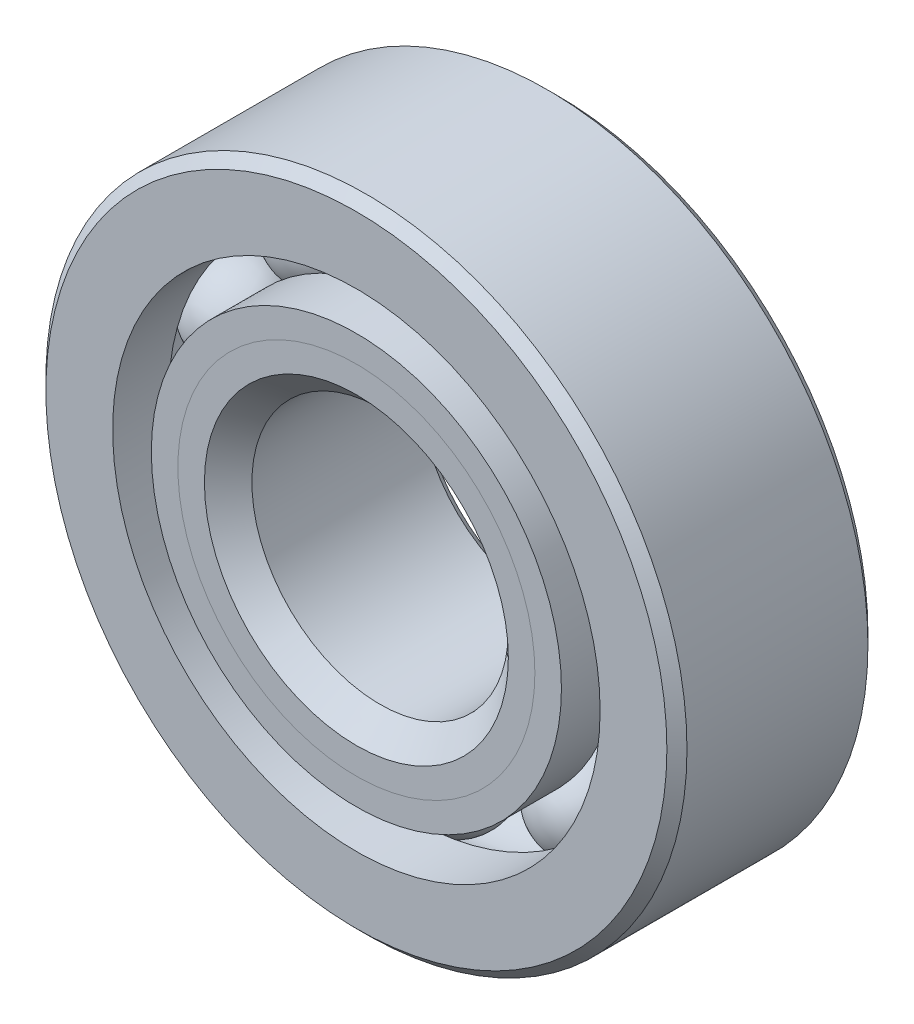
ISO-10303-21;
HEADER;
FILE_DESCRIPTION(('STEP AP214'),'2;1');
FILE_NAME('part.step','',(''),(''),'','','');
FILE_SCHEMA(('AUTOMOTIVE_DESIGN { 1 0 10303 214 1 1 1 1 }'));
ENDSEC;
DATA;
#1=APPLICATION_CONTEXT('core data for automotive mechanical design processes');
#2=APPLICATION_PROTOCOL_DEFINITION('international standard','automotive_design',2000,#1);
#3=PRODUCT_CONTEXT('',#1,'mechanical');
#4=PRODUCT('Part','Part','',(#3));
#5=PRODUCT_RELATED_PRODUCT_CATEGORY('part','',(#4));
#6=PRODUCT_DEFINITION_FORMATION('','',#4);
#7=PRODUCT_DEFINITION_CONTEXT('part definition',#1,'design');
#8=PRODUCT_DEFINITION('design','',#6,#7);
#9=PRODUCT_DEFINITION_SHAPE('','',#8);
#10=(LENGTH_UNIT() NAMED_UNIT(*) SI_UNIT(.MILLI.,.METRE.));
#11=(NAMED_UNIT(*) PLANE_ANGLE_UNIT() SI_UNIT($,.RADIAN.));
#12=(NAMED_UNIT(*) SI_UNIT($,.STERADIAN.) SOLID_ANGLE_UNIT());
#13=UNCERTAINTY_MEASURE_WITH_UNIT(LENGTH_MEASURE(1.E-05),#10,'distance_accuracy_value','');
#14=(GEOMETRIC_REPRESENTATION_CONTEXT(3) GLOBAL_UNCERTAINTY_ASSIGNED_CONTEXT((#13)) GLOBAL_UNIT_ASSIGNED_CONTEXT((#10,
#11,#12)) REPRESENTATION_CONTEXT('',''));
#15=CARTESIAN_POINT('',(0.,0.,0.));
#16=DIRECTION('',(0.,0.,1.));
#17=DIRECTION('',(1.,0.,0.));
#18=AXIS2_PLACEMENT_3D('',#15,#16,#17);
#19=CARTESIAN_POINT('',(-3.26588180805,4.49510067499584,0.));
#20=DIRECTION('',(0.,0.,1.));
#21=DIRECTION('',(-0.587785252292462,0.809016994374955,0.));
#22=AXIS2_PLACEMENT_3D('',#19,#20,#21);
#23=SPHERICAL_SURFACE('',#22,1.20554465033679);
#24=CARTESIAN_POINT('',(-3.26588180805,4.49510067499584,1.20554465033679));
#25=VERTEX_POINT('',#24);
#26=VERTEX_LOOP('',#25);
#27=FACE_BOUND('',#26,.T.);
#28=ADVANCED_FACE('F37',(#27),#23,.T.);
#29=CLOSED_SHELL('',(#28));
#30=MANIFOLD_SOLID_BREP('B2',#29);
#31=CARTESIAN_POINT('',(-5.28430776866493,1.71697567499586,0.));
#32=DIRECTION('',(0.,0.,1.));
#33=DIRECTION('',(-0.95105651629515,0.309016994374958,0.));
#34=AXIS2_PLACEMENT_3D('',#31,#32,#33);
#35=SPHERICAL_SURFACE('',#34,1.20554465033679);
#36=CARTESIAN_POINT('',(-5.28430776866493,1.71697567499586,1.20554465033679));
#37=VERTEX_POINT('',#36);
#38=VERTEX_LOOP('',#37);
#39=FACE_BOUND('',#38,.T.);
#40=ADVANCED_FACE('F68',(#39),#35,.T.);
#41=CLOSED_SHELL('',(#40));
#42=MANIFOLD_SOLID_BREP('B6',#41);
#43=CARTESIAN_POINT('',(-5.28430776866496,-1.71697567499575,0.));
#44=DIRECTION('',(0.,0.,1.));
#45=DIRECTION('',(-0.951056516295157,-0.309016994374938,0.));
#46=AXIS2_PLACEMENT_3D('',#43,#44,#45);
#47=SPHERICAL_SURFACE('',#46,1.20554465033679);
#48=CARTESIAN_POINT('',(-5.28430776866496,-1.71697567499575,1.20554465033679));
#49=VERTEX_POINT('',#48);
#50=VERTEX_LOOP('',#49);
#51=FACE_BOUND('',#50,.T.);
#52=ADVANCED_FACE('F99',(#51),#47,.T.);
#53=CLOSED_SHELL('',(#52));
#54=MANIFOLD_SOLID_BREP('B33',#53);
#55=CARTESIAN_POINT('',(-3.26588180805009,-4.49510067499577,0.));
#56=DIRECTION('',(0.,0.,1.));
#57=DIRECTION('',(-0.58778525229248,-0.809016994374942,0.));
#58=AXIS2_PLACEMENT_3D('',#55,#56,#57);
#59=SPHERICAL_SURFACE('',#58,1.20554465033679);
#60=CARTESIAN_POINT('',(-3.26588180805009,-4.49510067499577,1.20554465033679));
#61=VERTEX_POINT('',#60);
#62=VERTEX_LOOP('',#61);
#63=FACE_BOUND('',#62,.T.);
#64=ADVANCED_FACE('F130',(#63),#59,.T.);
#65=CLOSED_SHELL('',(#64));
#66=MANIFOLD_SOLID_BREP('B64',#65);
#67=CARTESIAN_POINT('',(0.,-5.55625,0.));
#68=DIRECTION('',(0.,0.,1.));
#69=DIRECTION('',(0.,-1.,0.));
#70=AXIS2_PLACEMENT_3D('',#67,#68,#69);
#71=SPHERICAL_SURFACE('',#70,1.20554465033679);
#72=CARTESIAN_POINT('',(0.,-5.55625,1.20554465033679));
#73=VERTEX_POINT('',#72);
#74=VERTEX_LOOP('',#73);
#75=FACE_BOUND('',#74,.T.);
#76=ADVANCED_FACE('F161',(#75),#71,.T.);
#77=CLOSED_SHELL('',(#76));
#78=MANIFOLD_SOLID_BREP('B95',#77);
#79=CARTESIAN_POINT('',(3.26588180805003,-4.49510067499582,0.));
#80=DIRECTION('',(0.,0.,1.));
#81=DIRECTION('',(0.587785252292469,-0.809016994374951,0.));
#82=AXIS2_PLACEMENT_3D('',#79,#80,#81);
#83=SPHERICAL_SURFACE('',#82,1.20554465033679);
#84=CARTESIAN_POINT('',(3.26588180805003,-4.49510067499582,1.20554465033679));
#85=VERTEX_POINT('',#84);
#86=VERTEX_LOOP('',#85);
#87=FACE_BOUND('',#86,.T.);
#88=ADVANCED_FACE('F192',(#87),#83,.T.);
#89=CLOSED_SHELL('',(#88));
#90=MANIFOLD_SOLID_BREP('B126',#89);
#91=CARTESIAN_POINT('',(5.28430776866494,-1.71697567499582,0.));
#92=DIRECTION('',(0.,0.,1.));
#93=DIRECTION('',(0.951056516295152,-0.309016994374952,0.));
#94=AXIS2_PLACEMENT_3D('',#91,#92,#93);
#95=SPHERICAL_SURFACE('',#94,1.20554465033679);
#96=CARTESIAN_POINT('',(5.28430776866494,-1.71697567499582,1.20554465033679));
#97=VERTEX_POINT('',#96);
#98=VERTEX_LOOP('',#97);
#99=FACE_BOUND('',#98,.T.);
#100=ADVANCED_FACE('F223',(#99),#95,.T.);
#101=CLOSED_SHELL('',(#100));
#102=MANIFOLD_SOLID_BREP('B157',#101);
#103=CARTESIAN_POINT('',(5.28430776866495,1.71697567499579,0.));
#104=DIRECTION('',(0.,0.,1.));
#105=DIRECTION('',(0.951056516295155,0.309016994374945,0.));
#106=AXIS2_PLACEMENT_3D('',#103,#104,#105);
#107=SPHERICAL_SURFACE('',#106,1.20554465033679);
#108=CARTESIAN_POINT('',(5.28430776866495,1.71697567499579,1.20554465033679));
#109=VERTEX_POINT('',#108);
#110=VERTEX_LOOP('',#109);
#111=FACE_BOUND('',#110,.T.);
#112=ADVANCED_FACE('F254',(#111),#107,.T.);
#113=CLOSED_SHELL('',(#112));
#114=MANIFOLD_SOLID_BREP('B188',#113);
#115=CARTESIAN_POINT('',(3.26588180805006,4.4951006749958,0.));
#116=DIRECTION('',(0.,0.,1.));
#117=DIRECTION('',(0.587785252292474,0.809016994374947,0.));
#118=AXIS2_PLACEMENT_3D('',#115,#116,#117);
#119=SPHERICAL_SURFACE('',#118,1.20554465033679);
#120=CARTESIAN_POINT('',(3.26588180805006,4.4951006749958,1.20554465033679));
#121=VERTEX_POINT('',#120);
#122=VERTEX_LOOP('',#121);
#123=FACE_BOUND('',#122,.T.);
#124=ADVANCED_FACE('F285',(#123),#119,.T.);
#125=CLOSED_SHELL('',(#124));
#126=MANIFOLD_SOLID_BREP('B219',#125);
#127=CARTESIAN_POINT('',(0.,5.55625,0.));
#128=DIRECTION('',(0.,0.,1.));
#129=DIRECTION('',(0.,1.,0.));
#130=AXIS2_PLACEMENT_3D('',#127,#128,#129);
#131=SPHERICAL_SURFACE('',#130,1.20554465033679);
#132=CARTESIAN_POINT('',(0.,5.55625,1.20554465033679));
#133=VERTEX_POINT('',#132);
#134=VERTEX_LOOP('',#133);
#135=FACE_BOUND('',#134,.T.);
#136=ADVANCED_FACE('F318',(#135),#131,.T.);
#137=CLOSED_SHELL('',(#136));
#138=MANIFOLD_SOLID_BREP('B250',#137);
#139=CARTESIAN_POINT('',(0.,4.42006562313009,2.4892));
#140=DIRECTION('',(0.,0.,-1.));
#141=DIRECTION('',(-1.,0.,0.));
#142=AXIS2_PLACEMENT_3D('',#139,#140,#141);
#143=PLANE('',#142);
#144=CARTESIAN_POINT('',(0.,0.,2.4892));
#145=DIRECTION('',(0.,0.,1.));
#146=DIRECTION('',(1.,0.,0.));
#147=AXIS2_PLACEMENT_3D('',#144,#145,#146);
#148=CIRCLE('',#147,3.7628526748316);
#149=CARTESIAN_POINT('',(3.7628526748316,0.,2.4892));
#150=VERTEX_POINT('',#149);
#151=EDGE_CURVE('E372',#150,#150,#148,.T.);
#152=ORIENTED_EDGE('',*,*,#151,.F.);
#153=EDGE_LOOP('',(#152));
#154=FACE_BOUND('',#153,.T.);
#155=CARTESIAN_POINT('',(0.,0.,2.4892));
#156=DIRECTION('',(0.,0.,1.));
#157=DIRECTION('',(1.,0.,0.));
#158=AXIS2_PLACEMENT_3D('',#155,#156,#157);
#159=CIRCLE('',#158,4.42006562313009);
#160=CARTESIAN_POINT('',(4.42006562313009,0.,2.4892));
#161=VERTEX_POINT('',#160);
#162=EDGE_CURVE('E317',#161,#161,#159,.T.);
#163=ORIENTED_EDGE('',*,*,#162,.T.);
#164=EDGE_LOOP('',(#163));
#165=FACE_BOUND('',#164,.T.);
#166=ADVANCED_FACE('F338',(#154,#165),#143,.F.);
#167=CARTESIAN_POINT('',(0.,0.,1.83198705170152));
#168=DIRECTION('',(0.,0.,1.));
#169=DIRECTION('',(1.,0.,0.));
#170=AXIS2_PLACEMENT_3D('',#167,#168,#169);
#171=CONICAL_SURFACE('',#170,3.7628526748316,0.78539816339745);
#172=ORIENTED_EDGE('',*,*,#162,.F.);
#173=EDGE_LOOP('',(#172));
#174=FACE_BOUND('',#173,.T.);
#175=CARTESIAN_POINT('',(0.,0.,1.83198705170152));
#176=DIRECTION('',(0.,0.,1.));
#177=DIRECTION('',(1.,0.,0.));
#178=AXIS2_PLACEMENT_3D('',#175,#176,#177);
#179=CIRCLE('',#178,3.7628526748316);
#180=CARTESIAN_POINT('',(3.7628526748316,0.,1.83198705170152));
#181=VERTEX_POINT('',#180);
#182=EDGE_CURVE('E344',#181,#181,#179,.T.);
#183=ORIENTED_EDGE('',*,*,#182,.T.);
#184=EDGE_LOOP('',(#183));
#185=FACE_BOUND('',#184,.T.);
#186=ADVANCED_FACE('F379',(#174,#185),#171,.T.);
#187=CARTESIAN_POINT('',(0.,0.,2.4892));
#188=DIRECTION('',(0.,0.,1.));
#189=DIRECTION('',(1.,0.,0.));
#190=AXIS2_PLACEMENT_3D('',#187,#188,#189);
#191=CYLINDRICAL_SURFACE('',#190,3.7628526748316);
#192=ORIENTED_EDGE('',*,*,#182,.F.);
#193=EDGE_LOOP('',(#192));
#194=FACE_BOUND('',#193,.T.);
#195=CARTESIAN_POINT('',(0.,0.,0.));
#196=DIRECTION('',(0.,0.,1.));
#197=DIRECTION('',(1.,0.,0.));
#198=AXIS2_PLACEMENT_3D('',#195,#196,#197);
#199=CIRCLE('',#198,3.7628526748316);
#200=CARTESIAN_POINT('',(3.7628526748316,0.,0.));
#201=VERTEX_POINT('',#200);
#202=EDGE_CURVE('E348',#201,#201,#199,.T.);
#203=ORIENTED_EDGE('',*,*,#202,.T.);
#204=EDGE_LOOP('',(#203));
#205=FACE_BOUND('',#204,.T.);
#206=ADVANCED_FACE('F383',(#194,#205),#191,.T.);
#207=CARTESIAN_POINT('',(0.,3.7628526748316,0.));
#208=DIRECTION('',(0.,0.,-1.));
#209=DIRECTION('',(-1.,0.,0.));
#210=AXIS2_PLACEMENT_3D('',#207,#208,#209);
#211=PLANE('',#210);
#212=ORIENTED_EDGE('',*,*,#202,.F.);
#213=EDGE_LOOP('',(#212));
#214=FACE_BOUND('',#213,.T.);
#215=CARTESIAN_POINT('',(0.,0.,0.));
#216=DIRECTION('',(0.,0.,1.));
#217=DIRECTION('',(1.,0.,0.));
#218=AXIS2_PLACEMENT_3D('',#215,#216,#217);
#219=CIRCLE('',#218,4.35070534966321);
#220=CARTESIAN_POINT('',(4.35070534966321,0.,0.));
#221=VERTEX_POINT('',#220);
#222=EDGE_CURVE('E352',#221,#221,#219,.T.);
#223=ORIENTED_EDGE('',*,*,#222,.T.);
#224=EDGE_LOOP('',(#223));
#225=FACE_BOUND('',#224,.T.);
#226=ADVANCED_FACE('F388',(#214,#225),#211,.F.);
#227=CARTESIAN_POINT('',(0.,0.,0.));
#228=DIRECTION('',(0.,0.,1.));
#229=DIRECTION('',(1.,0.,0.));
#230=AXIS2_PLACEMENT_3D('',#227,#228,#229);
#231=TOROIDAL_SURFACE('',#230,5.55625,1.20554465033679);
#232=ORIENTED_EDGE('',*,*,#222,.F.);
#233=EDGE_LOOP('',(#232));
#234=FACE_BOUND('',#233,.T.);
#235=CARTESIAN_POINT('',(0.,0.,-1.10631111111111));
#236=DIRECTION('',(0.,0.,1.));
#237=DIRECTION('',(1.,0.,0.));
#238=AXIS2_PLACEMENT_3D('',#235,#236,#237);
#239=CIRCLE('',#238,5.07727857142857);
#240=CARTESIAN_POINT('',(5.07727857142857,0.,-1.10631111111111));
#241=VERTEX_POINT('',#240);
#242=EDGE_CURVE('E357',#241,#241,#239,.T.);
#243=ORIENTED_EDGE('',*,*,#242,.T.);
#244=EDGE_LOOP('',(#243));
#245=FACE_BOUND('',#244,.T.);
#246=ADVANCED_FACE('F394',(#234,#245),#231,.F.);
#247=CARTESIAN_POINT('',(0.,0.,2.4892));
#248=DIRECTION('',(0.,0.,1.));
#249=DIRECTION('',(1.,0.,0.));
#250=AXIS2_PLACEMENT_3D('',#247,#248,#249);
#251=CYLINDRICAL_SURFACE('',#250,5.07727857142857);
#252=ORIENTED_EDGE('',*,*,#242,.F.);
#253=EDGE_LOOP('',(#252));
#254=FACE_BOUND('',#253,.T.);
#255=CARTESIAN_POINT('',(0.,0.,-2.4892));
#256=DIRECTION('',(0.,0.,1.));
#257=DIRECTION('',(1.,0.,0.));
#258=AXIS2_PLACEMENT_3D('',#255,#256,#257);
#259=CIRCLE('',#258,5.07727857142857);
#260=CARTESIAN_POINT('',(5.07727857142857,0.,-2.4892));
#261=VERTEX_POINT('',#260);
#262=EDGE_CURVE('E360',#261,#261,#259,.T.);
#263=ORIENTED_EDGE('',*,*,#262,.T.);
#264=EDGE_LOOP('',(#263));
#265=FACE_BOUND('',#264,.T.);
#266=ADVANCED_FACE('F398',(#254,#265),#251,.T.);
#267=CARTESIAN_POINT('',(0.,3.42392,-2.4892));
#268=DIRECTION('',(0.,0.,1.));
#269=DIRECTION('',(1.,0.,0.));
#270=AXIS2_PLACEMENT_3D('',#267,#268,#269);
#271=PLANE('',#270);
#272=ORIENTED_EDGE('',*,*,#262,.F.);
#273=EDGE_LOOP('',(#272));
#274=FACE_BOUND('',#273,.T.);
#275=CARTESIAN_POINT('',(0.,0.,-2.4892));
#276=DIRECTION('',(0.,0.,1.));
#277=DIRECTION('',(1.,0.,0.));
#278=AXIS2_PLACEMENT_3D('',#275,#276,#277);
#279=CIRCLE('',#278,3.42392);
#280=CARTESIAN_POINT('',(3.42392,0.,-2.4892));
#281=VERTEX_POINT('',#280);
#282=EDGE_CURVE('E363',#281,#281,#279,.T.);
#283=ORIENTED_EDGE('',*,*,#282,.T.);
#284=EDGE_LOOP('',(#283));
#285=FACE_BOUND('',#284,.T.);
#286=ADVANCED_FACE('F402',(#274,#285),#271,.F.);
#287=CARTESIAN_POINT('',(0.,0.,-2.24028));
#288=DIRECTION('',(0.,0.,-1.));
#289=DIRECTION('',(-1.,0.,0.));
#290=AXIS2_PLACEMENT_3D('',#287,#288,#289);
#291=CONICAL_SURFACE('',#290,3.175,0.785398163397447);
#292=ORIENTED_EDGE('',*,*,#282,.F.);
#293=EDGE_LOOP('',(#292));
#294=FACE_BOUND('',#293,.T.);
#295=CARTESIAN_POINT('',(0.,0.,-2.24028));
#296=DIRECTION('',(0.,0.,1.));
#297=DIRECTION('',(1.,0.,0.));
#298=AXIS2_PLACEMENT_3D('',#295,#296,#297);
#299=CIRCLE('',#298,3.175);
#300=CARTESIAN_POINT('',(3.175,0.,-2.24028));
#301=VERTEX_POINT('',#300);
#302=EDGE_CURVE('E366',#301,#301,#299,.T.);
#303=ORIENTED_EDGE('',*,*,#302,.T.);
#304=EDGE_LOOP('',(#303));
#305=FACE_BOUND('',#304,.T.);
#306=ADVANCED_FACE('F406',(#294,#305),#291,.F.);
#307=CARTESIAN_POINT('',(0.,0.,2.4892));
#308=DIRECTION('',(0.,0.,1.));
#309=DIRECTION('',(1.,0.,0.));
#310=AXIS2_PLACEMENT_3D('',#307,#308,#309);
#311=CYLINDRICAL_SURFACE('',#310,3.175);
#312=ORIENTED_EDGE('',*,*,#302,.F.);
#313=EDGE_LOOP('',(#312));
#314=FACE_BOUND('',#313,.T.);
#315=CARTESIAN_POINT('',(0.,0.,1.9013473251684));
#316=DIRECTION('',(0.,0.,1.));
#317=DIRECTION('',(1.,0.,0.));
#318=AXIS2_PLACEMENT_3D('',#315,#316,#317);
#319=CIRCLE('',#318,3.175);
#320=CARTESIAN_POINT('',(3.175,0.,1.9013473251684));
#321=VERTEX_POINT('',#320);
#322=EDGE_CURVE('E369',#321,#321,#319,.T.);
#323=ORIENTED_EDGE('',*,*,#322,.T.);
#324=EDGE_LOOP('',(#323));
#325=FACE_BOUND('',#324,.T.);
#326=ADVANCED_FACE('F410',(#314,#325),#311,.F.);
#327=CARTESIAN_POINT('',(0.,0.,2.4892));
#328=DIRECTION('',(0.,0.,1.));
#329=DIRECTION('',(1.,0.,0.));
#330=AXIS2_PLACEMENT_3D('',#327,#328,#329);
#331=CONICAL_SURFACE('',#330,3.7628526748316,0.785398163397449);
#332=ORIENTED_EDGE('',*,*,#322,.F.);
#333=EDGE_LOOP('',(#332));
#334=FACE_BOUND('',#333,.T.);
#335=ORIENTED_EDGE('',*,*,#151,.T.);
#336=EDGE_LOOP('',(#335));
#337=FACE_BOUND('',#336,.T.);
#338=ADVANCED_FACE('F376',(#334,#337),#331,.F.);
#339=CLOSED_SHELL('',(#166,#186,#206,#226,#246,#266,#286,#306,#326,#338));
#340=MANIFOLD_SOLID_BREP('B281',#339);
#341=CARTESIAN_POINT('',(0.,5.07727857142857,2.4892));
#342=DIRECTION('',(0.,0.,-1.));
#343=DIRECTION('',(-1.,0.,0.));
#344=AXIS2_PLACEMENT_3D('',#341,#342,#343);
#345=PLANE('',#344);
#346=CARTESIAN_POINT('',(0.,0.,2.4892));
#347=DIRECTION('',(0.,0.,1.));
#348=DIRECTION('',(1.,0.,0.));
#349=AXIS2_PLACEMENT_3D('',#346,#347,#348);
#350=CIRCLE('',#349,4.42006562313009);
#351=CARTESIAN_POINT('',(4.42006562313009,0.,2.4892));
#352=VERTEX_POINT('',#351);
#353=EDGE_CURVE('E337',#352,#352,#350,.T.);
#354=ORIENTED_EDGE('',*,*,#353,.F.);
#355=EDGE_LOOP('',(#354));
#356=FACE_BOUND('',#355,.T.);
#357=CARTESIAN_POINT('',(0.,0.,2.4892));
#358=DIRECTION('',(0.,0.,1.));
#359=DIRECTION('',(1.,0.,0.));
#360=AXIS2_PLACEMENT_3D('',#357,#358,#359);
#361=CIRCLE('',#360,5.07727857142857);
#362=CARTESIAN_POINT('',(5.07727857142857,0.,2.4892));
#363=VERTEX_POINT('',#362);
#364=EDGE_CURVE('E518',#363,#363,#361,.T.);
#365=ORIENTED_EDGE('',*,*,#364,.T.);
#366=EDGE_LOOP('',(#365));
#367=FACE_BOUND('',#366,.T.);
#368=ADVANCED_FACE('F496',(#356,#367),#345,.F.);
#369=CARTESIAN_POINT('',(0.,0.,2.4892));
#370=DIRECTION('',(0.,0.,1.));
#371=DIRECTION('',(1.,0.,0.));
#372=AXIS2_PLACEMENT_3D('',#369,#370,#371);
#373=CONICAL_SURFACE('',#372,4.42006562313009,0.78539816339745);
#374=CARTESIAN_POINT('',(0.,0.,1.83198705170152));
#375=DIRECTION('',(0.,0.,1.));
#376=DIRECTION('',(1.,0.,0.));
#377=AXIS2_PLACEMENT_3D('',#374,#375,#376);
#378=CIRCLE('',#377,3.7628526748316);
#379=CARTESIAN_POINT('',(3.7628526748316,0.,1.83198705170152));
#380=VERTEX_POINT('',#379);
#381=EDGE_CURVE('E502',#380,#380,#378,.T.);
#382=ORIENTED_EDGE('',*,*,#381,.F.);
#383=EDGE_LOOP('',(#382));
#384=FACE_BOUND('',#383,.T.);
#385=ORIENTED_EDGE('',*,*,#353,.T.);
#386=EDGE_LOOP('',(#385));
#387=FACE_BOUND('',#386,.T.);
#388=ADVANCED_FACE('F543',(#384,#387),#373,.F.);
#389=CARTESIAN_POINT('',(0.,0.,2.4892));
#390=DIRECTION('',(0.,0.,1.));
#391=DIRECTION('',(1.,0.,0.));
#392=AXIS2_PLACEMENT_3D('',#389,#390,#391);
#393=CYLINDRICAL_SURFACE('',#392,3.7628526748316);
#394=CARTESIAN_POINT('',(0.,0.,0.));
#395=DIRECTION('',(0.,0.,1.));
#396=DIRECTION('',(1.,0.,0.));
#397=AXIS2_PLACEMENT_3D('',#394,#395,#396);
#398=CIRCLE('',#397,3.7628526748316);
#399=CARTESIAN_POINT('',(3.7628526748316,0.,0.));
#400=VERTEX_POINT('',#399);
#401=EDGE_CURVE('E506',#400,#400,#398,.T.);
#402=ORIENTED_EDGE('',*,*,#401,.F.);
#403=EDGE_LOOP('',(#402));
#404=FACE_BOUND('',#403,.T.);
#405=ORIENTED_EDGE('',*,*,#381,.T.);
#406=EDGE_LOOP('',(#405));
#407=FACE_BOUND('',#406,.T.);
#408=ADVANCED_FACE('F538',(#404,#407),#393,.F.);
#409=CARTESIAN_POINT('',(0.,3.7628526748316,0.));
#410=DIRECTION('',(0.,0.,1.));
#411=DIRECTION('',(1.,0.,0.));
#412=AXIS2_PLACEMENT_3D('',#409,#410,#411);
#413=PLANE('',#412);
#414=CARTESIAN_POINT('',(0.,0.,0.));
#415=DIRECTION('',(0.,0.,1.));
#416=DIRECTION('',(1.,0.,0.));
#417=AXIS2_PLACEMENT_3D('',#414,#415,#416);
#418=CIRCLE('',#417,4.35070534966321);
#419=CARTESIAN_POINT('',(4.35070534966321,0.,0.));
#420=VERTEX_POINT('',#419);
#421=EDGE_CURVE('E510',#420,#420,#418,.T.);
#422=ORIENTED_EDGE('',*,*,#421,.F.);
#423=EDGE_LOOP('',(#422));
#424=FACE_BOUND('',#423,.T.);
#425=ORIENTED_EDGE('',*,*,#401,.T.);
#426=EDGE_LOOP('',(#425));
#427=FACE_BOUND('',#426,.T.);
#428=ADVANCED_FACE('F532',(#424,#427),#413,.F.);
#429=CARTESIAN_POINT('',(0.,0.,0.));
#430=DIRECTION('',(0.,0.,1.));
#431=DIRECTION('',(1.,0.,0.));
#432=AXIS2_PLACEMENT_3D('',#429,#430,#431);
#433=TOROIDAL_SURFACE('',#432,5.55625,1.20554465033679);
#434=CARTESIAN_POINT('',(0.,0.,1.10631111111111));
#435=DIRECTION('',(0.,0.,1.));
#436=DIRECTION('',(1.,0.,0.));
#437=AXIS2_PLACEMENT_3D('',#434,#435,#436);
#438=CIRCLE('',#437,5.07727857142857);
#439=CARTESIAN_POINT('',(5.07727857142857,0.,1.10631111111111));
#440=VERTEX_POINT('',#439);
#441=EDGE_CURVE('E515',#440,#440,#438,.T.);
#442=ORIENTED_EDGE('',*,*,#441,.F.);
#443=EDGE_LOOP('',(#442));
#444=FACE_BOUND('',#443,.T.);
#445=ORIENTED_EDGE('',*,*,#421,.T.);
#446=EDGE_LOOP('',(#445));
#447=FACE_BOUND('',#446,.T.);
#448=ADVANCED_FACE('F526',(#444,#447),#433,.F.);
#449=CARTESIAN_POINT('',(0.,0.,2.4892));
#450=DIRECTION('',(0.,0.,1.));
#451=DIRECTION('',(1.,0.,0.));
#452=AXIS2_PLACEMENT_3D('',#449,#450,#451);
#453=CYLINDRICAL_SURFACE('',#452,5.07727857142857);
#454=ORIENTED_EDGE('',*,*,#364,.F.);
#455=EDGE_LOOP('',(#454));
#456=FACE_BOUND('',#455,.T.);
#457=ORIENTED_EDGE('',*,*,#441,.T.);
#458=EDGE_LOOP('',(#457));
#459=FACE_BOUND('',#458,.T.);
#460=ADVANCED_FACE('F523',(#456,#459),#453,.T.);
#461=CLOSED_SHELL('',(#368,#388,#408,#428,#448,#460));
#462=MANIFOLD_SOLID_BREP('B312',#461);
#463=CARTESIAN_POINT('',(0.,0.,2.24028));
#464=DIRECTION('',(0.,0.,-1.));
#465=DIRECTION('',(-1.,0.,0.));
#466=AXIS2_PLACEMENT_3D('',#463,#464,#465);
#467=CONICAL_SURFACE('',#466,7.9375,0.785398163397447);
#468=CARTESIAN_POINT('',(0.,0.,2.4892));
#469=DIRECTION('',(0.,0.,1.));
#470=DIRECTION('',(1.,0.,0.));
#471=AXIS2_PLACEMENT_3D('',#468,#469,#470);
#472=CIRCLE('',#471,7.68858);
#473=CARTESIAN_POINT('',(7.68858,0.,2.4892));
#474=VERTEX_POINT('',#473);
#475=EDGE_CURVE('E615',#474,#474,#472,.T.);
#476=ORIENTED_EDGE('',*,*,#475,.F.);
#477=EDGE_LOOP('',(#476));
#478=FACE_BOUND('',#477,.T.);
#479=CARTESIAN_POINT('',(0.,0.,2.24028));
#480=DIRECTION('',(0.,0.,1.));
#481=DIRECTION('',(1.,0.,0.));
#482=AXIS2_PLACEMENT_3D('',#479,#480,#481);
#483=CIRCLE('',#482,7.9375);
#484=CARTESIAN_POINT('',(7.9375,0.,2.24028));
#485=VERTEX_POINT('',#484);
#486=EDGE_CURVE('E495',#485,#485,#483,.T.);
#487=ORIENTED_EDGE('',*,*,#486,.T.);
#488=EDGE_LOOP('',(#487));
#489=FACE_BOUND('',#488,.T.);
#490=ADVANCED_FACE('F587',(#478,#489),#467,.T.);
#491=CARTESIAN_POINT('',(0.,0.,2.4892));
#492=DIRECTION('',(0.,0.,1.));
#493=DIRECTION('',(1.,0.,0.));
#494=AXIS2_PLACEMENT_3D('',#491,#492,#493);
#495=CYLINDRICAL_SURFACE('',#494,7.9375);
#496=ORIENTED_EDGE('',*,*,#486,.F.);
#497=EDGE_LOOP('',(#496));
#498=FACE_BOUND('',#497,.T.);
#499=CARTESIAN_POINT('',(0.,0.,-2.24028));
#500=DIRECTION('',(0.,0.,1.));
#501=DIRECTION('',(1.,0.,0.));
#502=AXIS2_PLACEMENT_3D('',#499,#500,#501);
#503=CIRCLE('',#502,7.9375);
#504=CARTESIAN_POINT('',(7.9375,0.,-2.24028));
#505=VERTEX_POINT('',#504);
#506=EDGE_CURVE('E593',#505,#505,#503,.T.);
#507=ORIENTED_EDGE('',*,*,#506,.T.);
#508=EDGE_LOOP('',(#507));
#509=FACE_BOUND('',#508,.T.);
#510=ADVANCED_FACE('F622',(#498,#509),#495,.T.);
#511=CARTESIAN_POINT('',(0.,0.,-2.4892));
#512=DIRECTION('',(0.,0.,1.));
#513=DIRECTION('',(1.,0.,0.));
#514=AXIS2_PLACEMENT_3D('',#511,#512,#513);
#515=CONICAL_SURFACE('',#514,7.68858,0.785398163397445);
#516=ORIENTED_EDGE('',*,*,#506,.F.);
#517=EDGE_LOOP('',(#516));
#518=FACE_BOUND('',#517,.T.);
#519=CARTESIAN_POINT('',(0.,0.,-2.4892));
#520=DIRECTION('',(0.,0.,1.));
#521=DIRECTION('',(1.,0.,0.));
#522=AXIS2_PLACEMENT_3D('',#519,#520,#521);
#523=CIRCLE('',#522,7.68858);
#524=CARTESIAN_POINT('',(7.68858,0.,-2.4892));
#525=VERTEX_POINT('',#524);
#526=EDGE_CURVE('E597',#525,#525,#523,.T.);
#527=ORIENTED_EDGE('',*,*,#526,.T.);
#528=EDGE_LOOP('',(#527));
#529=FACE_BOUND('',#528,.T.);
#530=ADVANCED_FACE('F626',(#518,#529),#515,.T.);
#531=CARTESIAN_POINT('',(0.,7.68858,-2.4892));
#532=DIRECTION('',(0.,0.,1.));
#533=DIRECTION('',(1.,0.,0.));
#534=AXIS2_PLACEMENT_3D('',#531,#532,#533);
#535=PLANE('',#534);
#536=ORIENTED_EDGE('',*,*,#526,.F.);
#537=EDGE_LOOP('',(#536));
#538=FACE_BOUND('',#537,.T.);
#539=CARTESIAN_POINT('',(0.,0.,-2.4892));
#540=DIRECTION('',(0.,0.,1.));
#541=DIRECTION('',(1.,0.,0.));
#542=AXIS2_PLACEMENT_3D('',#539,#540,#541);
#543=CIRCLE('',#542,6.03522142857143);
#544=CARTESIAN_POINT('',(6.03522142857143,0.,-2.4892));
#545=VERTEX_POINT('',#544);
#546=EDGE_CURVE('E601',#545,#545,#543,.T.);
#547=ORIENTED_EDGE('',*,*,#546,.T.);
#548=EDGE_LOOP('',(#547));
#549=FACE_BOUND('',#548,.T.);
#550=ADVANCED_FACE('F631',(#538,#549),#535,.F.);
#551=CARTESIAN_POINT('',(0.,0.,2.4892));
#552=DIRECTION('',(0.,0.,1.));
#553=DIRECTION('',(1.,0.,0.));
#554=AXIS2_PLACEMENT_3D('',#551,#552,#553);
#555=CYLINDRICAL_SURFACE('',#554,6.03522142857143);
#556=ORIENTED_EDGE('',*,*,#546,.F.);
#557=EDGE_LOOP('',(#556));
#558=FACE_BOUND('',#557,.T.);
#559=CARTESIAN_POINT('',(0.,0.,-1.10631111111111));
#560=DIRECTION('',(0.,0.,1.));
#561=DIRECTION('',(1.,0.,0.));
#562=AXIS2_PLACEMENT_3D('',#559,#560,#561);
#563=CIRCLE('',#562,6.03522142857143);
#564=CARTESIAN_POINT('',(6.03522142857143,0.,-1.10631111111111));
#565=VERTEX_POINT('',#564);
#566=EDGE_CURVE('E606',#565,#565,#563,.T.);
#567=ORIENTED_EDGE('',*,*,#566,.T.);
#568=EDGE_LOOP('',(#567));
#569=FACE_BOUND('',#568,.T.);
#570=ADVANCED_FACE('F637',(#558,#569),#555,.F.);
#571=CARTESIAN_POINT('',(0.,0.,0.));
#572=DIRECTION('',(0.,0.,1.));
#573=DIRECTION('',(1.,0.,0.));
#574=AXIS2_PLACEMENT_3D('',#571,#572,#573);
#575=TOROIDAL_SURFACE('',#574,5.55625,1.20554465033679);
#576=ORIENTED_EDGE('',*,*,#566,.F.);
#577=EDGE_LOOP('',(#576));
#578=FACE_BOUND('',#577,.T.);
#579=CARTESIAN_POINT('',(0.,0.,1.10631111111111));
#580=DIRECTION('',(0.,0.,1.));
#581=DIRECTION('',(1.,0.,0.));
#582=AXIS2_PLACEMENT_3D('',#579,#580,#581);
#583=CIRCLE('',#582,6.03522142857143);
#584=CARTESIAN_POINT('',(6.03522142857143,0.,1.10631111111111));
#585=VERTEX_POINT('',#584);
#586=EDGE_CURVE('E609',#585,#585,#583,.T.);
#587=ORIENTED_EDGE('',*,*,#586,.T.);
#588=EDGE_LOOP('',(#587));
#589=FACE_BOUND('',#588,.T.);
#590=ADVANCED_FACE('F641',(#578,#589),#575,.F.);
#591=CARTESIAN_POINT('',(0.,0.,2.4892));
#592=DIRECTION('',(0.,0.,1.));
#593=DIRECTION('',(1.,0.,0.));
#594=AXIS2_PLACEMENT_3D('',#591,#592,#593);
#595=CYLINDRICAL_SURFACE('',#594,6.03522142857143);
#596=ORIENTED_EDGE('',*,*,#586,.F.);
#597=EDGE_LOOP('',(#596));
#598=FACE_BOUND('',#597,.T.);
#599=CARTESIAN_POINT('',(0.,0.,2.4892));
#600=DIRECTION('',(0.,0.,1.));
#601=DIRECTION('',(1.,0.,0.));
#602=AXIS2_PLACEMENT_3D('',#599,#600,#601);
#603=CIRCLE('',#602,6.03522142857143);
#604=CARTESIAN_POINT('',(6.03522142857143,0.,2.4892));
#605=VERTEX_POINT('',#604);
#606=EDGE_CURVE('E612',#605,#605,#603,.T.);
#607=ORIENTED_EDGE('',*,*,#606,.T.);
#608=EDGE_LOOP('',(#607));
#609=FACE_BOUND('',#608,.T.);
#610=ADVANCED_FACE('F645',(#598,#609),#595,.F.);
#611=CARTESIAN_POINT('',(0.,7.68858,2.4892));
#612=DIRECTION('',(0.,0.,-1.));
#613=DIRECTION('',(-1.,0.,0.));
#614=AXIS2_PLACEMENT_3D('',#611,#612,#613);
#615=PLANE('',#614);
#616=ORIENTED_EDGE('',*,*,#606,.F.);
#617=EDGE_LOOP('',(#616));
#618=FACE_BOUND('',#617,.T.);
#619=ORIENTED_EDGE('',*,*,#475,.T.);
#620=EDGE_LOOP('',(#619));
#621=FACE_BOUND('',#620,.T.);
#622=ADVANCED_FACE('F619',(#618,#621),#615,.F.);
#623=CLOSED_SHELL('',(#490,#510,#530,#550,#570,#590,#610,#622));
#624=MANIFOLD_SOLID_BREP('B332',#623);
#625=ADVANCED_BREP_SHAPE_REPRESENTATION('',(#18,#30,#42,#54,#66,#78,#90,#102,#114,#126,#138,
#340,#462,#624),#14);
#626=SHAPE_DEFINITION_REPRESENTATION(#9,#625);
ENDSEC;
END-ISO-10303-21;
